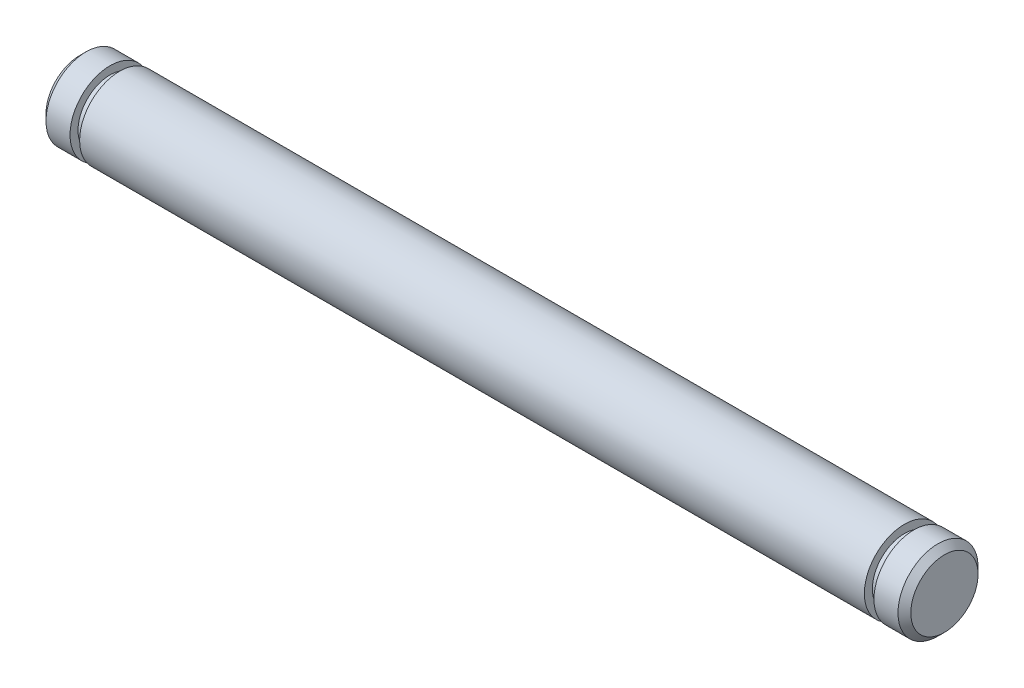
ISO-10303-21;
HEADER;
FILE_DESCRIPTION(('STEP AP214'),'2;1');
FILE_NAME('part.step','',(''),(''),'','','');
FILE_SCHEMA(('AUTOMOTIVE_DESIGN { 1 0 10303 214 1 1 1 1 }'));
ENDSEC;
DATA;
#1=APPLICATION_CONTEXT('core data for automotive mechanical design processes');
#2=APPLICATION_PROTOCOL_DEFINITION('international standard','automotive_design',2000,#1);
#3=PRODUCT_CONTEXT('',#1,'mechanical');
#4=PRODUCT('Part','Part','',(#3));
#5=PRODUCT_RELATED_PRODUCT_CATEGORY('part','',(#4));
#6=PRODUCT_DEFINITION_FORMATION('','',#4);
#7=PRODUCT_DEFINITION_CONTEXT('part definition',#1,'design');
#8=PRODUCT_DEFINITION('design','',#6,#7);
#9=PRODUCT_DEFINITION_SHAPE('','',#8);
#10=(LENGTH_UNIT() NAMED_UNIT(*) SI_UNIT(.MILLI.,.METRE.));
#11=(NAMED_UNIT(*) PLANE_ANGLE_UNIT() SI_UNIT($,.RADIAN.));
#12=(NAMED_UNIT(*) SI_UNIT($,.STERADIAN.) SOLID_ANGLE_UNIT());
#13=UNCERTAINTY_MEASURE_WITH_UNIT(LENGTH_MEASURE(1.E-05),#10,'distance_accuracy_value','');
#14=(GEOMETRIC_REPRESENTATION_CONTEXT(3) GLOBAL_UNCERTAINTY_ASSIGNED_CONTEXT((#13)) GLOBAL_UNIT_ASSIGNED_CONTEXT((#10,
#11,#12)) REPRESENTATION_CONTEXT('',''));
#15=CARTESIAN_POINT('',(0.,0.,0.));
#16=DIRECTION('',(0.,0.,1.));
#17=DIRECTION('',(1.,0.,0.));
#18=AXIS2_PLACEMENT_3D('',#15,#16,#17);
#19=CARTESIAN_POINT('',(52.1,0.,0.));
#20=DIRECTION('',(-1.,0.,0.));
#21=DIRECTION('',(0.,0.,1.));
#22=AXIS2_PLACEMENT_3D('',#19,#20,#21);
#23=PLANE('',#22);
#24=CARTESIAN_POINT('',(52.1,0.,0.));
#25=DIRECTION('',(-1.,0.,0.));
#26=DIRECTION('',(0.,0.,1.));
#27=AXIS2_PLACEMENT_3D('',#24,#25,#26);
#28=CIRCLE('',#27,2.1);
#29=CARTESIAN_POINT('',(52.1,0.,2.1));
#30=VERTEX_POINT('',#29);
#31=EDGE_CURVE('E10',#30,#30,#28,.T.);
#32=ORIENTED_EDGE('',*,*,#31,.F.);
#33=EDGE_LOOP('',(#32));
#34=FACE_BOUND('',#33,.T.);
#35=ADVANCED_FACE('F37',(#34),#23,.F.);
#36=CARTESIAN_POINT('',(52.1,0.,0.));
#37=DIRECTION('',(-1.,0.,0.));
#38=DIRECTION('',(0.,0.,1.));
#39=AXIS2_PLACEMENT_3D('',#36,#37,#38);
#40=CONICAL_SURFACE('',#39,2.1,0.785398163397452);
#41=CARTESIAN_POINT('',(51.7,0.,0.));
#42=DIRECTION('',(-1.,0.,0.));
#43=DIRECTION('',(0.,0.,1.));
#44=AXIS2_PLACEMENT_3D('',#41,#42,#43);
#45=CIRCLE('',#44,2.5);
#46=CARTESIAN_POINT('',(51.7,0.,2.5));
#47=VERTEX_POINT('',#46);
#48=EDGE_CURVE('E43',#47,#47,#45,.T.);
#49=ORIENTED_EDGE('',*,*,#48,.F.);
#50=EDGE_LOOP('',(#49));
#51=FACE_BOUND('',#50,.T.);
#52=ORIENTED_EDGE('',*,*,#31,.T.);
#53=EDGE_LOOP('',(#52));
#54=FACE_BOUND('',#53,.T.);
#55=ADVANCED_FACE('F139',(#51,#54),#40,.T.);
#56=CARTESIAN_POINT('',(-4.6,0.,0.));
#57=DIRECTION('',(-1.,0.,0.));
#58=DIRECTION('',(0.,0.,1.));
#59=AXIS2_PLACEMENT_3D('',#56,#57,#58);
#60=CYLINDRICAL_SURFACE('',#59,2.5);
#61=CARTESIAN_POINT('',(50.2,0.,0.));
#62=DIRECTION('',(-1.,0.,0.));
#63=DIRECTION('',(0.,0.,1.));
#64=AXIS2_PLACEMENT_3D('',#61,#62,#63);
#65=CIRCLE('',#64,2.5);
#66=CARTESIAN_POINT('',(50.2,0.,2.5));
#67=VERTEX_POINT('',#66);
#68=EDGE_CURVE('E47',#67,#67,#65,.T.);
#69=ORIENTED_EDGE('',*,*,#68,.F.);
#70=EDGE_LOOP('',(#69));
#71=FACE_BOUND('',#70,.T.);
#72=ORIENTED_EDGE('',*,*,#48,.T.);
#73=EDGE_LOOP('',(#72));
#74=FACE_BOUND('',#73,.T.);
#75=ADVANCED_FACE('F134',(#71,#74),#60,.T.);
#76=CARTESIAN_POINT('',(50.2,2.5,0.));
#77=DIRECTION('',(1.,0.,0.));
#78=DIRECTION('',(0.,0.,-1.));
#79=AXIS2_PLACEMENT_3D('',#76,#77,#78);
#80=PLANE('',#79);
#81=CARTESIAN_POINT('',(50.2,0.,0.));
#82=DIRECTION('',(-1.,0.,0.));
#83=DIRECTION('',(0.,0.,1.));
#84=AXIS2_PLACEMENT_3D('',#81,#82,#83);
#85=CIRCLE('',#84,2.);
#86=CARTESIAN_POINT('',(50.2,0.,2.));
#87=VERTEX_POINT('',#86);
#88=EDGE_CURVE('E51',#87,#87,#85,.T.);
#89=ORIENTED_EDGE('',*,*,#88,.F.);
#90=EDGE_LOOP('',(#89));
#91=FACE_BOUND('',#90,.T.);
#92=ORIENTED_EDGE('',*,*,#68,.T.);
#93=EDGE_LOOP('',(#92));
#94=FACE_BOUND('',#93,.T.);
#95=ADVANCED_FACE('F128',(#91,#94),#80,.F.);
#96=CARTESIAN_POINT('',(-4.6,0.,0.));
#97=DIRECTION('',(-1.,0.,0.));
#98=DIRECTION('',(0.,0.,1.));
#99=AXIS2_PLACEMENT_3D('',#96,#97,#98);
#100=CYLINDRICAL_SURFACE('',#99,2.);
#101=CARTESIAN_POINT('',(49.6,0.,0.));
#102=DIRECTION('',(-1.,0.,0.));
#103=DIRECTION('',(0.,0.,1.));
#104=AXIS2_PLACEMENT_3D('',#101,#102,#103);
#105=CIRCLE('',#104,2.);
#106=CARTESIAN_POINT('',(49.6,0.,2.));
#107=VERTEX_POINT('',#106);
#108=EDGE_CURVE('E56',#107,#107,#105,.T.);
#109=ORIENTED_EDGE('',*,*,#108,.F.);
#110=EDGE_LOOP('',(#109));
#111=FACE_BOUND('',#110,.T.);
#112=ORIENTED_EDGE('',*,*,#88,.T.);
#113=EDGE_LOOP('',(#112));
#114=FACE_BOUND('',#113,.T.);
#115=ADVANCED_FACE('F122',(#111,#114),#100,.T.);
#116=CARTESIAN_POINT('',(49.6,2.5,0.));
#117=DIRECTION('',(-1.,0.,0.));
#118=DIRECTION('',(0.,0.,1.));
#119=AXIS2_PLACEMENT_3D('',#116,#117,#118);
#120=PLANE('',#119);
#121=CARTESIAN_POINT('',(49.6,0.,0.));
#122=DIRECTION('',(-1.,0.,0.));
#123=DIRECTION('',(0.,0.,1.));
#124=AXIS2_PLACEMENT_3D('',#121,#122,#123);
#125=CIRCLE('',#124,2.5);
#126=CARTESIAN_POINT('',(49.6,0.,2.5));
#127=VERTEX_POINT('',#126);
#128=EDGE_CURVE('E59',#127,#127,#125,.T.);
#129=ORIENTED_EDGE('',*,*,#128,.F.);
#130=EDGE_LOOP('',(#129));
#131=FACE_BOUND('',#130,.T.);
#132=ORIENTED_EDGE('',*,*,#108,.T.);
#133=EDGE_LOOP('',(#132));
#134=FACE_BOUND('',#133,.T.);
#135=ADVANCED_FACE('F116',(#131,#134),#120,.F.);
#136=CARTESIAN_POINT('',(-4.6,0.,0.));
#137=DIRECTION('',(-1.,0.,0.));
#138=DIRECTION('',(0.,0.,1.));
#139=AXIS2_PLACEMENT_3D('',#136,#137,#138);
#140=CYLINDRICAL_SURFACE('',#139,2.5);
#141=CARTESIAN_POINT('',(0.6,0.,0.));
#142=DIRECTION('',(-1.,0.,0.));
#143=DIRECTION('',(0.,0.,1.));
#144=AXIS2_PLACEMENT_3D('',#141,#142,#143);
#145=CIRCLE('',#144,2.5);
#146=CARTESIAN_POINT('',(0.6,0.,2.5));
#147=VERTEX_POINT('',#146);
#148=EDGE_CURVE('E62',#147,#147,#145,.T.);
#149=ORIENTED_EDGE('',*,*,#148,.F.);
#150=EDGE_LOOP('',(#149));
#151=FACE_BOUND('',#150,.T.);
#152=ORIENTED_EDGE('',*,*,#128,.T.);
#153=EDGE_LOOP('',(#152));
#154=FACE_BOUND('',#153,.T.);
#155=ADVANCED_FACE('F110',(#151,#154),#140,.T.);
#156=CARTESIAN_POINT('',(0.6,2.5,0.));
#157=DIRECTION('',(1.,0.,0.));
#158=DIRECTION('',(0.,0.,-1.));
#159=AXIS2_PLACEMENT_3D('',#156,#157,#158);
#160=PLANE('',#159);
#161=CARTESIAN_POINT('',(0.6,0.,0.));
#162=DIRECTION('',(-1.,0.,0.));
#163=DIRECTION('',(0.,0.,1.));
#164=AXIS2_PLACEMENT_3D('',#161,#162,#163);
#165=CIRCLE('',#164,2.);
#166=CARTESIAN_POINT('',(0.6,0.,2.));
#167=VERTEX_POINT('',#166);
#168=EDGE_CURVE('E65',#167,#167,#165,.T.);
#169=ORIENTED_EDGE('',*,*,#168,.F.);
#170=EDGE_LOOP('',(#169));
#171=FACE_BOUND('',#170,.T.);
#172=ORIENTED_EDGE('',*,*,#148,.T.);
#173=EDGE_LOOP('',(#172));
#174=FACE_BOUND('',#173,.T.);
#175=ADVANCED_FACE('F104',(#171,#174),#160,.F.);
#176=CARTESIAN_POINT('',(-4.6,0.,0.));
#177=DIRECTION('',(-1.,0.,0.));
#178=DIRECTION('',(0.,0.,1.));
#179=AXIS2_PLACEMENT_3D('',#176,#177,#178);
#180=CYLINDRICAL_SURFACE('',#179,2.);
#181=CARTESIAN_POINT('',(0.,0.,0.));
#182=DIRECTION('',(-1.,0.,0.));
#183=DIRECTION('',(0.,0.,1.));
#184=AXIS2_PLACEMENT_3D('',#181,#182,#183);
#185=CIRCLE('',#184,2.);
#186=CARTESIAN_POINT('',(0.,0.,2.));
#187=VERTEX_POINT('',#186);
#188=EDGE_CURVE('E68',#187,#187,#185,.T.);
#189=ORIENTED_EDGE('',*,*,#188,.F.);
#190=EDGE_LOOP('',(#189));
#191=FACE_BOUND('',#190,.T.);
#192=ORIENTED_EDGE('',*,*,#168,.T.);
#193=EDGE_LOOP('',(#192));
#194=FACE_BOUND('',#193,.T.);
#195=ADVANCED_FACE('F98',(#191,#194),#180,.T.);
#196=CARTESIAN_POINT('',(0.,2.5,0.));
#197=DIRECTION('',(-1.,0.,0.));
#198=DIRECTION('',(0.,0.,1.));
#199=AXIS2_PLACEMENT_3D('',#196,#197,#198);
#200=PLANE('',#199);
#201=CARTESIAN_POINT('',(0.,0.,0.));
#202=DIRECTION('',(-1.,0.,0.));
#203=DIRECTION('',(0.,0.,1.));
#204=AXIS2_PLACEMENT_3D('',#201,#202,#203);
#205=CIRCLE('',#204,2.5);
#206=CARTESIAN_POINT('',(0.,0.,2.5));
#207=VERTEX_POINT('',#206);
#208=EDGE_CURVE('E71',#207,#207,#205,.T.);
#209=ORIENTED_EDGE('',*,*,#208,.F.);
#210=EDGE_LOOP('',(#209));
#211=FACE_BOUND('',#210,.T.);
#212=ORIENTED_EDGE('',*,*,#188,.T.);
#213=EDGE_LOOP('',(#212));
#214=FACE_BOUND('',#213,.T.);
#215=ADVANCED_FACE('F92',(#211,#214),#200,.F.);
#216=CARTESIAN_POINT('',(-4.6,0.,0.));
#217=DIRECTION('',(-1.,0.,0.));
#218=DIRECTION('',(0.,0.,1.));
#219=AXIS2_PLACEMENT_3D('',#216,#217,#218);
#220=CYLINDRICAL_SURFACE('',#219,2.5);
#221=CARTESIAN_POINT('',(-1.5,0.,0.));
#222=DIRECTION('',(-1.,0.,0.));
#223=DIRECTION('',(0.,0.,1.));
#224=AXIS2_PLACEMENT_3D('',#221,#222,#223);
#225=CIRCLE('',#224,2.5);
#226=CARTESIAN_POINT('',(-1.5,0.,2.5));
#227=VERTEX_POINT('',#226);
#228=EDGE_CURVE('E74',#227,#227,#225,.T.);
#229=ORIENTED_EDGE('',*,*,#228,.F.);
#230=EDGE_LOOP('',(#229));
#231=FACE_BOUND('',#230,.T.);
#232=ORIENTED_EDGE('',*,*,#208,.T.);
#233=EDGE_LOOP('',(#232));
#234=FACE_BOUND('',#233,.T.);
#235=ADVANCED_FACE('F86',(#231,#234),#220,.T.);
#236=CARTESIAN_POINT('',(-1.5,0.,0.));
#237=DIRECTION('',(1.,0.,0.));
#238=DIRECTION('',(0.,0.,-1.));
#239=AXIS2_PLACEMENT_3D('',#236,#237,#238);
#240=CONICAL_SURFACE('',#239,2.5,0.785398163397448);
#241=CARTESIAN_POINT('',(-1.9,0.,0.));
#242=DIRECTION('',(-1.,0.,0.));
#243=DIRECTION('',(0.,0.,1.));
#244=AXIS2_PLACEMENT_3D('',#241,#242,#243);
#245=CIRCLE('',#244,2.1);
#246=CARTESIAN_POINT('',(-1.9,0.,2.1));
#247=VERTEX_POINT('',#246);
#248=EDGE_CURVE('E77',#247,#247,#245,.T.);
#249=ORIENTED_EDGE('',*,*,#248,.F.);
#250=EDGE_LOOP('',(#249));
#251=FACE_BOUND('',#250,.T.);
#252=ORIENTED_EDGE('',*,*,#228,.T.);
#253=EDGE_LOOP('',(#252));
#254=FACE_BOUND('',#253,.T.);
#255=ADVANCED_FACE('F83',(#251,#254),#240,.T.);
#256=CARTESIAN_POINT('',(-1.9,0.,0.));
#257=DIRECTION('',(1.,0.,0.));
#258=DIRECTION('',(0.,0.,-1.));
#259=AXIS2_PLACEMENT_3D('',#256,#257,#258);
#260=PLANE('',#259);
#261=ORIENTED_EDGE('',*,*,#248,.T.);
#262=EDGE_LOOP('',(#261));
#263=FACE_BOUND('',#262,.T.);
#264=ADVANCED_FACE('F81',(#263),#260,.F.);
#265=CLOSED_SHELL('',(#35,#55,#75,#95,#115,#135,#155,#175,#195,#215,#235,#255,#264));
#266=MANIFOLD_SOLID_BREP('B2',#265);
#267=ADVANCED_BREP_SHAPE_REPRESENTATION('',(#18,#266),#14);
#268=SHAPE_DEFINITION_REPRESENTATION(#9,#267);
ENDSEC;
END-ISO-10303-21;
